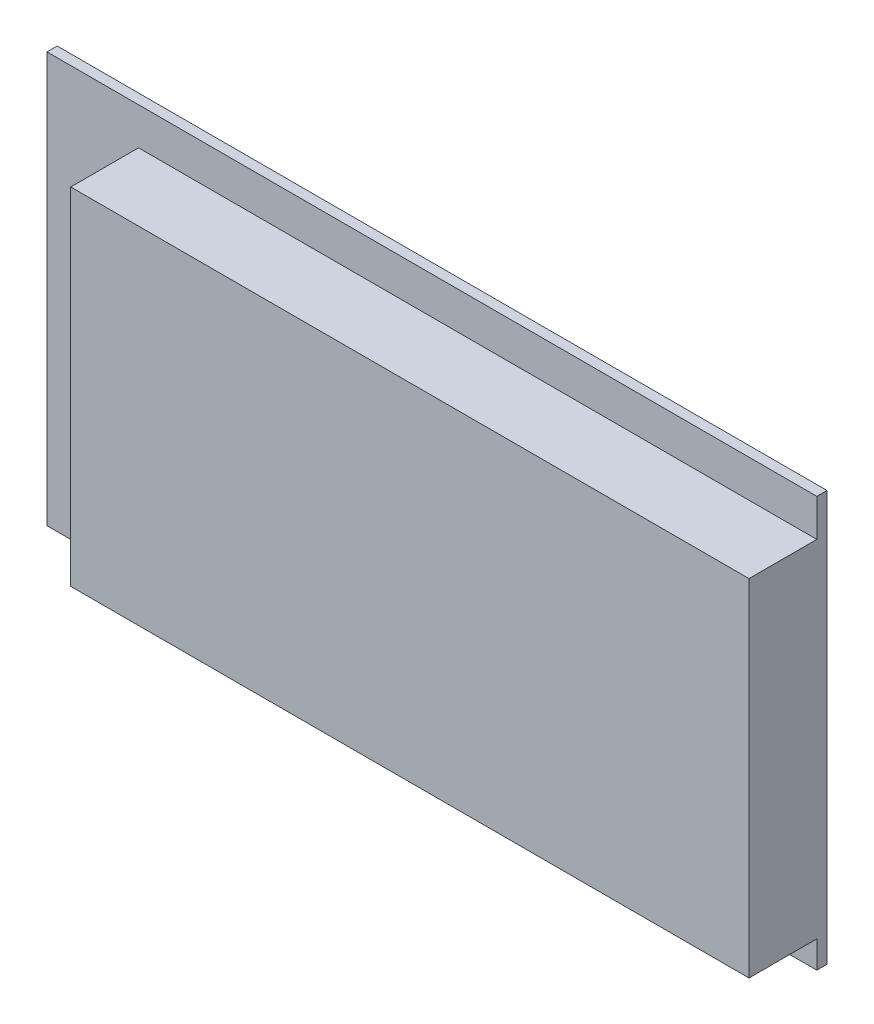
ISO-10303-21;
HEADER;
FILE_DESCRIPTION(('STEP AP214'),'2;1');
FILE_NAME('part.step','',(''),(''),'','','');
FILE_SCHEMA(('AUTOMOTIVE_DESIGN { 1 0 10303 214 1 1 1 1 }'));
ENDSEC;
DATA;
#1=APPLICATION_CONTEXT('core data for automotive mechanical design processes');
#2=APPLICATION_PROTOCOL_DEFINITION('international standard','automotive_design',2000,#1);
#3=PRODUCT_CONTEXT('',#1,'mechanical');
#4=PRODUCT('Part','Part','',(#3));
#5=PRODUCT_RELATED_PRODUCT_CATEGORY('part','',(#4));
#6=PRODUCT_DEFINITION_FORMATION('','',#4);
#7=PRODUCT_DEFINITION_CONTEXT('part definition',#1,'design');
#8=PRODUCT_DEFINITION('design','',#6,#7);
#9=PRODUCT_DEFINITION_SHAPE('','',#8);
#10=(LENGTH_UNIT() NAMED_UNIT(*) SI_UNIT(.MILLI.,.METRE.));
#11=(NAMED_UNIT(*) PLANE_ANGLE_UNIT() SI_UNIT($,.RADIAN.));
#12=(NAMED_UNIT(*) SI_UNIT($,.STERADIAN.) SOLID_ANGLE_UNIT());
#13=UNCERTAINTY_MEASURE_WITH_UNIT(LENGTH_MEASURE(1.E-05),#10,'distance_accuracy_value','');
#14=(GEOMETRIC_REPRESENTATION_CONTEXT(3) GLOBAL_UNCERTAINTY_ASSIGNED_CONTEXT((#13)) GLOBAL_UNIT_ASSIGNED_CONTEXT((#10,
#11,#12)) REPRESENTATION_CONTEXT('',''));
#15=CARTESIAN_POINT('',(0.,0.,0.));
#16=DIRECTION('',(0.,0.,1.));
#17=DIRECTION('',(1.,0.,0.));
#18=AXIS2_PLACEMENT_3D('',#15,#16,#17);
#19=CARTESIAN_POINT('',(0.,0.,1.5));
#20=DIRECTION('',(0.,0.,-1.));
#21=DIRECTION('',(-1.,0.,0.));
#22=AXIS2_PLACEMENT_3D('',#19,#20,#21);
#23=PLANE('',#22);
#24=DIRECTION('',(-1.,0.,0.));
#25=VECTOR('',#24,1.);
#26=CARTESIAN_POINT('',(13.5,55.,1.5));
#27=LINE('',#26,#25);
#28=CARTESIAN_POINT('',(113.5,55.,1.5));
#29=VERTEX_POINT('',#28);
#30=CARTESIAN_POINT('',(13.5,55.,1.5));
#31=VERTEX_POINT('',#30);
#32=EDGE_CURVE('E117',#29,#31,#27,.T.);
#33=ORIENTED_EDGE('',*,*,#32,.F.);
#34=DIRECTION('',(0.,1.,0.));
#35=VECTOR('',#34,1.);
#36=CARTESIAN_POINT('',(113.5,0.,1.5));
#37=LINE('',#36,#35);
#38=CARTESIAN_POINT('',(113.5,60.5,1.5));
#39=VERTEX_POINT('',#38);
#40=EDGE_CURVE('E137',#29,#39,#37,.T.);
#41=ORIENTED_EDGE('',*,*,#40,.T.);
#42=DIRECTION('',(-1.,0.,0.));
#43=VECTOR('',#42,1.);
#44=CARTESIAN_POINT('',(0.,60.5,1.5));
#45=LINE('',#44,#43);
#46=CARTESIAN_POINT('',(0.,60.5,1.5));
#47=VERTEX_POINT('',#46);
#48=EDGE_CURVE('E140',#39,#47,#45,.T.);
#49=ORIENTED_EDGE('',*,*,#48,.T.);
#50=DIRECTION('',(0.,-1.,0.));
#51=VECTOR('',#50,1.);
#52=CARTESIAN_POINT('',(0.,0.,1.5));
#53=LINE('',#52,#51);
#54=CARTESIAN_POINT('',(0.,0.,1.5));
#55=VERTEX_POINT('',#54);
#56=EDGE_CURVE('E131',#47,#55,#53,.T.);
#57=ORIENTED_EDGE('',*,*,#56,.T.);
#58=DIRECTION('',(1.,0.,0.));
#59=VECTOR('',#58,1.);
#60=CARTESIAN_POINT('',(0.,0.,1.5));
#61=LINE('',#60,#59);
#62=CARTESIAN_POINT('',(113.5,0.,1.5));
#63=VERTEX_POINT('',#62);
#64=EDGE_CURVE('E134',#55,#63,#61,.T.);
#65=ORIENTED_EDGE('',*,*,#64,.T.);
#66=CARTESIAN_POINT('',(113.5,4.,1.5));
#67=VERTEX_POINT('',#66);
#68=EDGE_CURVE('E145',#63,#67,#37,.T.);
#69=ORIENTED_EDGE('',*,*,#68,.T.);
#70=DIRECTION('',(1.,0.,0.));
#71=VECTOR('',#70,1.);
#72=CARTESIAN_POINT('',(13.5,4.,1.5));
#73=LINE('',#72,#71);
#74=CARTESIAN_POINT('',(13.5,4.,1.5));
#75=VERTEX_POINT('',#74);
#76=EDGE_CURVE('E55',#75,#67,#73,.T.);
#77=ORIENTED_EDGE('',*,*,#76,.F.);
#78=DIRECTION('',(0.,-1.,0.));
#79=VECTOR('',#78,1.);
#80=CARTESIAN_POINT('',(13.5,4.,1.5));
#81=LINE('',#80,#79);
#82=EDGE_CURVE('E50',#31,#75,#81,.T.);
#83=ORIENTED_EDGE('',*,*,#82,.F.);
#84=EDGE_LOOP('',(#33,#41,#49,#57,#65,#69,#77,#83));
#85=FACE_BOUND('',#84,.T.);
#86=ADVANCED_FACE('F33',(#85),#23,.F.);
#87=CARTESIAN_POINT('',(0.,0.,1.5));
#88=DIRECTION('',(1.,0.,0.));
#89=DIRECTION('',(0.,0.,-1.));
#90=AXIS2_PLACEMENT_3D('',#87,#88,#89);
#91=PLANE('',#90);
#92=DIRECTION('',(0.,-1.,0.));
#93=VECTOR('',#92,1.);
#94=CARTESIAN_POINT('',(0.,0.,0.));
#95=LINE('',#94,#93);
#96=CARTESIAN_POINT('',(0.,60.5,0.));
#97=VERTEX_POINT('',#96);
#98=CARTESIAN_POINT('',(0.,0.,0.));
#99=VERTEX_POINT('',#98);
#100=EDGE_CURVE('E120',#97,#99,#95,.T.);
#101=ORIENTED_EDGE('',*,*,#100,.T.);
#102=DIRECTION('',(0.,0.,-1.));
#103=VECTOR('',#102,1.);
#104=CARTESIAN_POINT('',(0.,0.,1.5));
#105=LINE('',#104,#103);
#106=EDGE_CURVE('E11',#55,#99,#105,.T.);
#107=ORIENTED_EDGE('',*,*,#106,.F.);
#108=ORIENTED_EDGE('',*,*,#56,.F.);
#109=DIRECTION('',(0.,0.,-1.));
#110=VECTOR('',#109,1.);
#111=CARTESIAN_POINT('',(0.,60.5,1.5));
#112=LINE('',#111,#110);
#113=EDGE_CURVE('E152',#47,#97,#112,.T.);
#114=ORIENTED_EDGE('',*,*,#113,.T.);
#115=EDGE_LOOP('',(#101,#107,#108,#114));
#116=FACE_BOUND('',#115,.T.);
#117=ADVANCED_FACE('F35',(#116),#91,.F.);
#118=CARTESIAN_POINT('',(0.,0.,1.5));
#119=DIRECTION('',(0.,1.,0.));
#120=DIRECTION('',(0.,0.,1.));
#121=AXIS2_PLACEMENT_3D('',#118,#119,#120);
#122=PLANE('',#121);
#123=DIRECTION('',(1.,0.,0.));
#124=VECTOR('',#123,1.);
#125=CARTESIAN_POINT('',(0.,0.,0.));
#126=LINE('',#125,#124);
#127=CARTESIAN_POINT('',(113.5,0.,0.));
#128=VERTEX_POINT('',#127);
#129=EDGE_CURVE('E123',#99,#128,#126,.T.);
#130=ORIENTED_EDGE('',*,*,#129,.T.);
#131=DIRECTION('',(0.,0.,-1.));
#132=VECTOR('',#131,1.);
#133=CARTESIAN_POINT('',(113.5,0.,1.5));
#134=LINE('',#133,#132);
#135=EDGE_CURVE('E42',#63,#128,#134,.T.);
#136=ORIENTED_EDGE('',*,*,#135,.F.);
#137=ORIENTED_EDGE('',*,*,#64,.F.);
#138=ORIENTED_EDGE('',*,*,#106,.T.);
#139=EDGE_LOOP('',(#130,#136,#137,#138));
#140=FACE_BOUND('',#139,.T.);
#141=ADVANCED_FACE('F160',(#140),#122,.F.);
#142=CARTESIAN_POINT('',(113.5,0.,1.5));
#143=DIRECTION('',(-1.,0.,0.));
#144=DIRECTION('',(0.,0.,1.));
#145=AXIS2_PLACEMENT_3D('',#142,#143,#144);
#146=PLANE('',#145);
#147=DIRECTION('',(0.,1.,0.));
#148=VECTOR('',#147,1.);
#149=CARTESIAN_POINT('',(113.5,0.,0.));
#150=LINE('',#149,#148);
#151=CARTESIAN_POINT('',(113.5,60.5,0.));
#152=VERTEX_POINT('',#151);
#153=EDGE_CURVE('E156',#128,#152,#150,.T.);
#154=ORIENTED_EDGE('',*,*,#153,.T.);
#155=DIRECTION('',(0.,0.,-1.));
#156=VECTOR('',#155,1.);
#157=CARTESIAN_POINT('',(113.5,60.5,1.5));
#158=LINE('',#157,#156);
#159=EDGE_CURVE('E149',#39,#152,#158,.T.);
#160=ORIENTED_EDGE('',*,*,#159,.F.);
#161=ORIENTED_EDGE('',*,*,#40,.F.);
#162=DIRECTION('',(0.,0.,-1.));
#163=VECTOR('',#162,1.);
#164=CARTESIAN_POINT('',(113.5,55.,11.5));
#165=LINE('',#164,#163);
#166=CARTESIAN_POINT('',(113.5,55.,11.5));
#167=VERTEX_POINT('',#166);
#168=EDGE_CURVE('E125',#167,#29,#165,.T.);
#169=ORIENTED_EDGE('',*,*,#168,.F.);
#170=DIRECTION('',(0.,1.,0.));
#171=VECTOR('',#170,1.);
#172=CARTESIAN_POINT('',(113.5,4.,11.5));
#173=LINE('',#172,#171);
#174=CARTESIAN_POINT('',(113.5,4.,11.5));
#175=VERTEX_POINT('',#174);
#176=EDGE_CURVE('E107',#175,#167,#173,.T.);
#177=ORIENTED_EDGE('',*,*,#176,.F.);
#178=DIRECTION('',(0.,0.,-1.));
#179=VECTOR('',#178,1.);
#180=CARTESIAN_POINT('',(113.5,4.,11.5));
#181=LINE('',#180,#179);
#182=EDGE_CURVE('E104',#175,#67,#181,.T.);
#183=ORIENTED_EDGE('',*,*,#182,.T.);
#184=ORIENTED_EDGE('',*,*,#68,.F.);
#185=ORIENTED_EDGE('',*,*,#135,.T.);
#186=EDGE_LOOP('',(#154,#160,#161,#169,#177,#183,#184,#185));
#187=FACE_BOUND('',#186,.T.);
#188=ADVANCED_FACE('F167',(#187),#146,.F.);
#189=CARTESIAN_POINT('',(0.,60.5,1.5));
#190=DIRECTION('',(0.,-1.,0.));
#191=DIRECTION('',(0.,0.,-1.));
#192=AXIS2_PLACEMENT_3D('',#189,#190,#191);
#193=PLANE('',#192);
#194=DIRECTION('',(-1.,0.,0.));
#195=VECTOR('',#194,1.);
#196=CARTESIAN_POINT('',(0.,60.5,0.));
#197=LINE('',#196,#195);
#198=EDGE_CURVE('E135',#152,#97,#197,.T.);
#199=ORIENTED_EDGE('',*,*,#198,.T.);
#200=ORIENTED_EDGE('',*,*,#113,.F.);
#201=ORIENTED_EDGE('',*,*,#48,.F.);
#202=ORIENTED_EDGE('',*,*,#159,.T.);
#203=EDGE_LOOP('',(#199,#200,#201,#202));
#204=FACE_BOUND('',#203,.T.);
#205=ADVANCED_FACE('F173',(#204),#193,.F.);
#206=CARTESIAN_POINT('',(0.,0.,0.));
#207=DIRECTION('',(0.,0.,-1.));
#208=DIRECTION('',(-1.,0.,0.));
#209=AXIS2_PLACEMENT_3D('',#206,#207,#208);
#210=PLANE('',#209);
#211=ORIENTED_EDGE('',*,*,#100,.F.);
#212=ORIENTED_EDGE('',*,*,#198,.F.);
#213=ORIENTED_EDGE('',*,*,#153,.F.);
#214=ORIENTED_EDGE('',*,*,#129,.F.);
#215=EDGE_LOOP('',(#211,#212,#213,#214));
#216=FACE_BOUND('',#215,.T.);
#217=ADVANCED_FACE('F170',(#216),#210,.T.);
#218=CARTESIAN_POINT('',(13.5,4.,11.5));
#219=DIRECTION('',(1.,0.,0.));
#220=DIRECTION('',(0.,0.,-1.));
#221=AXIS2_PLACEMENT_3D('',#218,#219,#220);
#222=PLANE('',#221);
#223=ORIENTED_EDGE('',*,*,#82,.T.);
#224=DIRECTION('',(0.,0.,-1.));
#225=VECTOR('',#224,1.);
#226=CARTESIAN_POINT('',(13.5,4.,11.5));
#227=LINE('',#226,#225);
#228=CARTESIAN_POINT('',(13.5,4.,11.5));
#229=VERTEX_POINT('',#228);
#230=EDGE_CURVE('E102',#229,#75,#227,.T.);
#231=ORIENTED_EDGE('',*,*,#230,.F.);
#232=DIRECTION('',(0.,-1.,0.));
#233=VECTOR('',#232,1.);
#234=CARTESIAN_POINT('',(13.5,4.,11.5));
#235=LINE('',#234,#233);
#236=CARTESIAN_POINT('',(13.5,55.,11.5));
#237=VERTEX_POINT('',#236);
#238=EDGE_CURVE('E108',#237,#229,#235,.T.);
#239=ORIENTED_EDGE('',*,*,#238,.F.);
#240=DIRECTION('',(0.,0.,-1.));
#241=VECTOR('',#240,1.);
#242=CARTESIAN_POINT('',(13.5,55.,11.5));
#243=LINE('',#242,#241);
#244=EDGE_CURVE('E129',#237,#31,#243,.T.);
#245=ORIENTED_EDGE('',*,*,#244,.T.);
#246=EDGE_LOOP('',(#223,#231,#239,#245));
#247=FACE_BOUND('',#246,.T.);
#248=ADVANCED_FACE('F119',(#247),#222,.F.);
#249=CARTESIAN_POINT('',(13.5,4.,11.5));
#250=DIRECTION('',(0.,1.,0.));
#251=DIRECTION('',(0.,0.,1.));
#252=AXIS2_PLACEMENT_3D('',#249,#250,#251);
#253=PLANE('',#252);
#254=ORIENTED_EDGE('',*,*,#76,.T.);
#255=ORIENTED_EDGE('',*,*,#182,.F.);
#256=DIRECTION('',(1.,0.,0.));
#257=VECTOR('',#256,1.);
#258=CARTESIAN_POINT('',(13.5,4.,11.5));
#259=LINE('',#258,#257);
#260=EDGE_CURVE('E98',#229,#175,#259,.T.);
#261=ORIENTED_EDGE('',*,*,#260,.F.);
#262=ORIENTED_EDGE('',*,*,#230,.T.);
#263=EDGE_LOOP('',(#254,#255,#261,#262));
#264=FACE_BOUND('',#263,.T.);
#265=ADVANCED_FACE('F100',(#264),#253,.F.);
#266=CARTESIAN_POINT('',(13.5,55.,11.5));
#267=DIRECTION('',(0.,-1.,0.));
#268=DIRECTION('',(0.,0.,-1.));
#269=AXIS2_PLACEMENT_3D('',#266,#267,#268);
#270=PLANE('',#269);
#271=ORIENTED_EDGE('',*,*,#32,.T.);
#272=ORIENTED_EDGE('',*,*,#244,.F.);
#273=DIRECTION('',(-1.,0.,0.));
#274=VECTOR('',#273,1.);
#275=CARTESIAN_POINT('',(13.5,55.,11.5));
#276=LINE('',#275,#274);
#277=EDGE_CURVE('E113',#167,#237,#276,.T.);
#278=ORIENTED_EDGE('',*,*,#277,.F.);
#279=ORIENTED_EDGE('',*,*,#168,.T.);
#280=EDGE_LOOP('',(#271,#272,#278,#279));
#281=FACE_BOUND('',#280,.T.);
#282=ADVANCED_FACE('F181',(#281),#270,.F.);
#283=CARTESIAN_POINT('',(0.,0.,11.5));
#284=DIRECTION('',(0.,0.,-1.));
#285=DIRECTION('',(-1.,0.,0.));
#286=AXIS2_PLACEMENT_3D('',#283,#284,#285);
#287=PLANE('',#286);
#288=ORIENTED_EDGE('',*,*,#238,.T.);
#289=ORIENTED_EDGE('',*,*,#260,.T.);
#290=ORIENTED_EDGE('',*,*,#176,.T.);
#291=ORIENTED_EDGE('',*,*,#277,.T.);
#292=EDGE_LOOP('',(#288,#289,#290,#291));
#293=FACE_BOUND('',#292,.T.);
#294=ADVANCED_FACE('F111',(#293),#287,.F.);
#295=CLOSED_SHELL('',(#86,#117,#141,#188,#205,#217,#248,#265,#282,#294));
#296=MANIFOLD_SOLID_BREP('B2',#295);
#297=ADVANCED_BREP_SHAPE_REPRESENTATION('',(#18,#296),#14);
#298=SHAPE_DEFINITION_REPRESENTATION(#9,#297);
ENDSEC;
END-ISO-10303-21;
